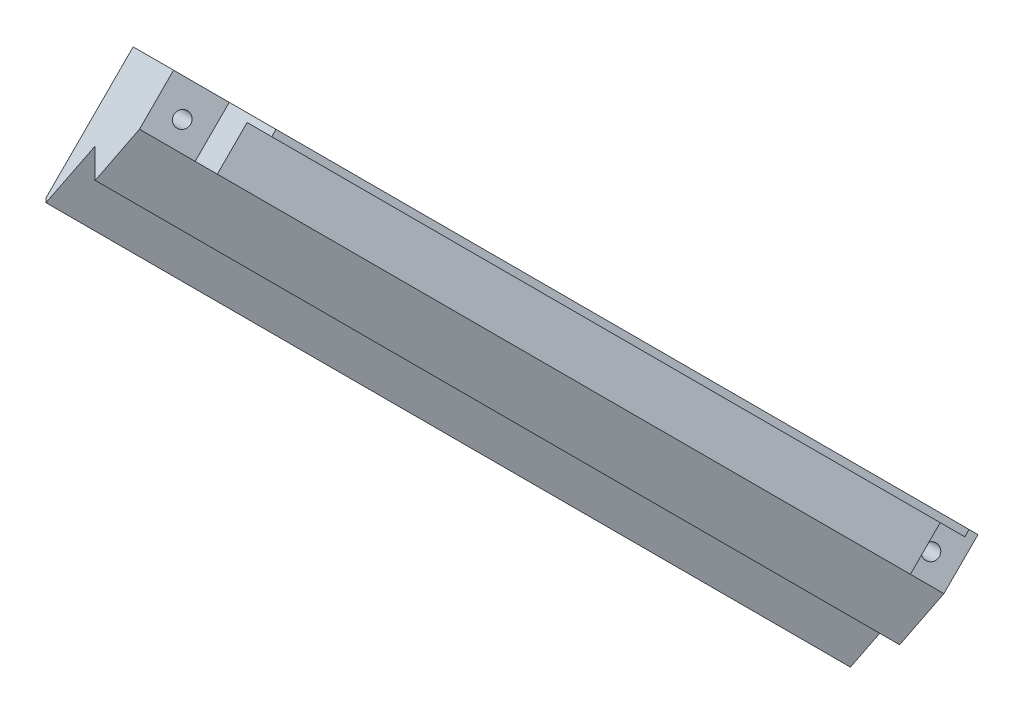
ISO-10303-21;
HEADER;
FILE_DESCRIPTION(('STEP AP214'),'2;1');
FILE_NAME('part.step','',(''),(''),'','','');
FILE_SCHEMA(('AUTOMOTIVE_DESIGN { 1 0 10303 214 1 1 1 1 }'));
ENDSEC;
DATA;
#1=APPLICATION_CONTEXT('core data for automotive mechanical design processes');
#2=APPLICATION_PROTOCOL_DEFINITION('international standard','automotive_design',2000,#1);
#3=PRODUCT_CONTEXT('',#1,'mechanical');
#4=PRODUCT('Part','Part','',(#3));
#5=PRODUCT_RELATED_PRODUCT_CATEGORY('part','',(#4));
#6=PRODUCT_DEFINITION_FORMATION('','',#4);
#7=PRODUCT_DEFINITION_CONTEXT('part definition',#1,'design');
#8=PRODUCT_DEFINITION('design','',#6,#7);
#9=PRODUCT_DEFINITION_SHAPE('','',#8);
#10=(LENGTH_UNIT() NAMED_UNIT(*) SI_UNIT(.MILLI.,.METRE.));
#11=(NAMED_UNIT(*) PLANE_ANGLE_UNIT() SI_UNIT($,.RADIAN.));
#12=(NAMED_UNIT(*) SI_UNIT($,.STERADIAN.) SOLID_ANGLE_UNIT());
#13=UNCERTAINTY_MEASURE_WITH_UNIT(LENGTH_MEASURE(1.E-05),#10,'distance_accuracy_value','');
#14=(GEOMETRIC_REPRESENTATION_CONTEXT(3) GLOBAL_UNCERTAINTY_ASSIGNED_CONTEXT((#13)) GLOBAL_UNIT_ASSIGNED_CONTEXT((#10,
#11,#12)) REPRESENTATION_CONTEXT('',''));
#15=CARTESIAN_POINT('',(0.,0.,0.));
#16=DIRECTION('',(0.,0.,1.));
#17=DIRECTION('',(1.,0.,0.));
#18=AXIS2_PLACEMENT_3D('',#15,#16,#17);
#19=CARTESIAN_POINT('',(109.704877872,0.,155.146126145066));
#20=DIRECTION('',(0.,0.707106781186548,-0.707106781186548));
#21=DIRECTION('',(0.,0.707106781186548,0.707106781186548));
#22=AXIS2_PLACEMENT_3D('',#19,#20,#21);
#23=PLANE('',#22);
#24=DIRECTION('',(0.577677514831549,-0.577186576792135,-0.577186576792135));
#25=VECTOR('',#24,1.);
#26=CARTESIAN_POINT('',(28.8678567839204,-30.6177683850488,124.528357760018));
#27=LINE('',#26,#25);
#28=CARTESIAN_POINT('',(28.8678567839204,-30.6177683850488,124.528357760018));
#29=VERTEX_POINT('',#28);
#30=CARTESIAN_POINT('',(30.6080010146896,-32.356433757848,122.789692387218));
#31=VERTEX_POINT('',#30);
#32=EDGE_CURVE('E419',#29,#31,#27,.T.);
#33=ORIENTED_EDGE('',*,*,#32,.T.);
#34=DIRECTION('',(0.335280806511777,0.666178197175804,0.666178197175807));
#35=VECTOR('',#34,1.);
#36=CARTESIAN_POINT('',(30.6080010146896,-32.356433757848,122.789692387219));
#37=LINE('',#36,#35);
#38=CARTESIAN_POINT('',(32.6559777775101,-28.2872552029885,126.858870942078));
#39=VERTEX_POINT('',#38);
#40=EDGE_CURVE('E64',#31,#39,#37,.T.);
#41=ORIENTED_EDGE('',*,*,#40,.T.);
#42=DIRECTION('',(-0.579378844719787,0.576333303866473,0.576333303866366));
#43=VECTOR('',#42,1.);
#44=CARTESIAN_POINT('',(32.6559777775101,-28.2872552029885,126.858870942078));
#45=LINE('',#44,#43);
#46=CARTESIAN_POINT('',(32.5809276973819,-28.2125996282641,126.933526516802));
#47=VERTEX_POINT('',#46);
#48=EDGE_CURVE('E452',#39,#47,#45,.T.);
#49=ORIENTED_EDGE('',*,*,#48,.T.);
#50=DIRECTION('',(-0.816269111123673,-0.408475665263776,-0.408475665263777));
#51=VECTOR('',#50,1.);
#52=CARTESIAN_POINT('',(32.5809276973819,-28.2125996282641,126.933526516802));
#53=LINE('',#52,#51);
#54=CARTESIAN_POINT('',(28.9950603095614,-30.0070318159176,125.139094329149));
#55=VERTEX_POINT('',#54);
#56=EDGE_CURVE('E448',#47,#55,#53,.T.);
#57=ORIENTED_EDGE('',*,*,#56,.T.);
#58=DIRECTION('',(-0.577600406502366,0.577225159884897,0.577225159884907));
#59=VECTOR('',#58,1.);
#60=CARTESIAN_POINT('',(28.9950603095614,-30.0070318159176,125.139094329149));
#61=LINE('',#60,#59);
#62=CARTESIAN_POINT('',(28.5549361108435,-29.5671935503725,125.578932594694));
#63=VERTEX_POINT('',#62);
#64=EDGE_CURVE('E444',#55,#63,#61,.T.);
#65=ORIENTED_EDGE('',*,*,#64,.T.);
#66=DIRECTION('',(-0.816148802675803,-0.408595846706047,-0.408595846706035));
#67=VECTOR('',#66,1.);
#68=CARTESIAN_POINT('',(28.5549361108435,-29.5671935503725,125.578932594694));
#69=LINE('',#68,#67);
#70=CARTESIAN_POINT('',(28.0626584666127,-29.8136468934387,125.332479251628));
#71=VERTEX_POINT('',#70);
#72=EDGE_CURVE('E440',#63,#71,#69,.T.);
#73=ORIENTED_EDGE('',*,*,#72,.T.);
#74=DIRECTION('',(0.577600406502369,-0.577225159884891,-0.57722515988491));
#75=VECTOR('',#74,1.);
#76=CARTESIAN_POINT('',(28.0626584666127,-29.8136468934387,125.332479251628));
#77=LINE('',#76,#75);
#78=CARTESIAN_POINT('',(28.5027826653307,-30.2534851589838,124.892640986083));
#79=VERTEX_POINT('',#78);
#80=EDGE_CURVE('E436',#71,#79,#77,.T.);
#81=ORIENTED_EDGE('',*,*,#80,.T.);
#82=DIRECTION('',(-0.816246040447928,-0.408498715697545,-0.408498715697535));
#83=VECTOR('',#82,1.);
#84=CARTESIAN_POINT('',(28.5027826653307,-30.2534851589838,124.892640986083));
#85=LINE('',#84,#83);
#86=CARTESIAN_POINT('',(27.3057974890486,-30.8525286862907,124.293597458776));
#87=VERTEX_POINT('',#86);
#88=EDGE_CURVE('E432',#79,#87,#85,.T.);
#89=ORIENTED_EDGE('',*,*,#88,.T.);
#90=DIRECTION('',(0.578185016321361,-0.57693244270948,-0.576932442709491));
#91=VECTOR('',#90,1.);
#92=CARTESIAN_POINT('',(27.3057974890486,-30.8525286862907,124.293597458776));
#93=LINE('',#92,#91);
#94=CARTESIAN_POINT('',(27.6708716076384,-31.2168119123557,123.929314232711));
#95=VERTEX_POINT('',#94);
#96=EDGE_CURVE('E428',#87,#95,#93,.T.);
#97=ORIENTED_EDGE('',*,*,#96,.T.);
#98=DIRECTION('',(0.816246040447931,0.408498715697537,0.408498715697537));
#99=VECTOR('',#98,1.);
#100=CARTESIAN_POINT('',(27.6708716076384,-31.2168119123557,123.929314232711));
#101=LINE('',#100,#99);
#102=EDGE_CURVE('E424',#95,#29,#101,.T.);
#103=ORIENTED_EDGE('',*,*,#102,.T.);
#104=EDGE_LOOP('',(#33,#41,#49,#57,#65,#73,#81,#89,#97,#103));
#105=FACE_BOUND('',#104,.T.);
#106=DIRECTION('',(0.5773502691896,-0.577350269189639,-0.577350269189639));
#107=VECTOR('',#106,1.);
#108=CARTESIAN_POINT('',(38.4539107675018,-35.6254835522467,119.52064259282));
#109=LINE('',#108,#107);
#110=CARTESIAN_POINT('',(10.7425199215219,-7.91409270626494,147.232033438801));
#111=VERTEX_POINT('',#110);
#112=CARTESIAN_POINT('',(13.0519209982803,-10.2234937830235,144.922632362043));
#113=VERTEX_POINT('',#112);
#114=EDGE_CURVE('E224',#111,#113,#109,.T.);
#115=ORIENTED_EDGE('',*,*,#114,.T.);
#116=DIRECTION('',(0.81649658092775,0.408248290463839,0.408248290463839));
#117=VECTOR('',#116,1.);
#118=CARTESIAN_POINT('',(84.3028881027793,25.4019897692229,180.548115914289));
#119=LINE('',#118,#117);
#120=CARTESIAN_POINT('',(20.8086383505286,-6.34513510689969,148.800991038167));
#121=VERTEX_POINT('',#120);
#122=EDGE_CURVE('E523',#113,#121,#119,.T.);
#123=ORIENTED_EDGE('',*,*,#122,.T.);
#124=DIRECTION('',(0.577350269189633,-0.577350269189622,-0.577350269189622));
#125=VECTOR('',#124,1.);
#126=CARTESIAN_POINT('',(18.3525903053945,-3.88908706176727,151.257039083299));
#127=LINE('',#126,#125);
#128=CARTESIAN_POINT('',(49.5596162817953,-35.0961130381675,120.050013106899));
#129=VERTEX_POINT('',#128);
#130=EDGE_CURVE('E259',#121,#129,#127,.T.);
#131=ORIENTED_EDGE('',*,*,#130,.T.);
#132=DIRECTION('',(0.816496580927721,0.408248290463868,0.408248290463868));
#133=VECTOR('',#132,1.);
#134=CARTESIAN_POINT('',(113.053866034043,-3.34898816204304,151.797137983023));
#135=LINE('',#134,#133);
#136=CARTESIAN_POINT('',(41.8028989295473,-38.9744717142916,116.171654430775));
#137=VERTEX_POINT('',#136);
#138=EDGE_CURVE('E50',#137,#129,#135,.T.);
#139=ORIENTED_EDGE('',*,*,#138,.F.);
#140=DIRECTION('',(-0.577350269189625,0.577350269189626,0.577350269189626));
#141=VECTOR('',#140,1.);
#142=CARTESIAN_POINT('',(38.4539107675038,-35.625483552248,119.520642592818));
#143=LINE('',#142,#141);
#144=CARTESIAN_POINT('',(44.1123000063058,-41.28387279105,113.862253354016));
#145=VERTEX_POINT('',#144);
#146=EDGE_CURVE('E287',#145,#137,#143,.T.);
#147=ORIENTED_EDGE('',*,*,#146,.F.);
#148=DIRECTION('',(0.816496580927739,0.40824829046385,0.40824829046385));
#149=VECTOR('',#148,1.);
#150=CARTESIAN_POINT('',(115.363267110803,-5.65838923880318,149.487736906263));
#151=LINE('',#150,#149);
#152=CARTESIAN_POINT('',(37.4055141149248,-44.6372657367405,110.508860408326));
#153=VERTEX_POINT('',#152);
#154=EDGE_CURVE('E275',#153,#145,#151,.T.);
#155=ORIENTED_EDGE('',*,*,#154,.F.);
#156=DIRECTION('',(-0.577350269189617,0.577350269189631,0.57735026918963));
#157=VECTOR('',#156,1.);
#158=CARTESIAN_POINT('',(37.4055141149248,-44.6372657367405,110.508860408326));
#159=LINE('',#158,#157);
#160=CARTESIAN_POINT('',(4.03573403014051,-11.2674856519554,143.878640493111));
#161=VERTEX_POINT('',#160);
#162=EDGE_CURVE('E280',#153,#161,#159,.T.);
#163=ORIENTED_EDGE('',*,*,#162,.T.);
#164=DIRECTION('',(-0.816496580927732,-0.408248290463857,-0.408248290463857));
#165=VECTOR('',#164,1.);
#166=CARTESIAN_POINT('',(81.9934870260181,27.7113908459825,182.857516991049));
#167=LINE('',#166,#165);
#168=EDGE_CURVE('E283',#111,#161,#167,.T.);
#169=ORIENTED_EDGE('',*,*,#168,.F.);
#170=EDGE_LOOP('',(#115,#123,#131,#139,#147,#155,#163,#169));
#171=FACE_BOUND('',#170,.T.);
#172=ADVANCED_FACE('F41',(#105,#171),#23,.T.);
#173=CARTESIAN_POINT('',(18.4992372737687,-4.38928743204907,151.463945516833));
#174=DIRECTION('',(0.577350269189617,-0.577350269189631,-0.57735026918963));
#175=DIRECTION('',(0.,0.707106781186547,-0.707106781186548));
#176=AXIS2_PLACEMENT_3D('',#173,#174,#175);
#177=PLANE('',#176);
#178=DIRECTION('',(0.,-0.707106781186592,0.707106781186503));
#179=VECTOR('',#178,1.);
#180=CARTESIAN_POINT('',(10.7425199215206,12.386673147035,126.931267585504));
#181=LINE('',#180,#179);
#182=CARTESIAN_POINT('',(10.7425199215221,-10.7425199215226,150.060460654059));
#183=VERTEX_POINT('',#182);
#184=EDGE_CURVE('E216',#111,#183,#181,.T.);
#185=ORIENTED_EDGE('',*,*,#184,.F.);
#186=ORIENTED_EDGE('',*,*,#168,.T.);
#187=DIRECTION('',(0.,-0.707106781186545,0.70710678118655));
#188=VECTOR('',#187,1.);
#189=CARTESIAN_POINT('',(4.03573403014054,-18.49923727377,151.110392114926));
#190=LINE('',#189,#188);
#191=CARTESIAN_POINT('',(4.03573403014057,-18.49923727377,151.110392114926));
#192=VERTEX_POINT('',#191);
#193=EDGE_CURVE('E331',#161,#192,#190,.T.);
#194=ORIENTED_EDGE('',*,*,#193,.T.);
#195=DIRECTION('',(-0.70710678118655,0.,-0.707106781186545));
#196=VECTOR('',#195,1.);
#197=CARTESIAN_POINT('',(0.853753502780497,-18.49923727377,147.928411587566));
#198=LINE('',#197,#196);
#199=CARTESIAN_POINT('',(4.38928743204753,-18.49923727377,151.463945516833));
#200=VERTEX_POINT('',#199);
#201=EDGE_CURVE('E238',#200,#192,#198,.T.);
#202=ORIENTED_EDGE('',*,*,#201,.F.);
#203=DIRECTION('',(-0.408248290463871,-0.816496580927723,0.408248290463862));
#204=VECTOR('',#203,1.);
#205=CARTESIAN_POINT('',(35.0681428707689,42.8584736036713,120.785090078112));
#206=LINE('',#205,#204);
#207=CARTESIAN_POINT('',(6.43052884599153,-14.4167544458821,149.422704102889));
#208=VERTEX_POINT('',#207);
#209=EDGE_CURVE('E281',#208,#200,#206,.T.);
#210=ORIENTED_EDGE('',*,*,#209,.F.);
#211=DIRECTION('',(-0.70710678118655,0.,-0.707106781186545));
#212=VECTOR('',#211,1.);
#213=CARTESIAN_POINT('',(6.43052884599175,-14.4167544458821,149.422704102889));
#214=LINE('',#213,#212);
#215=CARTESIAN_POINT('',(8.90540265934042,-14.4167544458821,151.897577916238));
#216=VERTEX_POINT('',#215);
#217=EDGE_CURVE('E234',#216,#208,#214,.T.);
#218=ORIENTED_EDGE('',*,*,#217,.F.);
#219=DIRECTION('',(-0.408248290463866,-0.816496580927723,0.408248290463866));
#220=VECTOR('',#219,1.);
#221=CARTESIAN_POINT('',(48.6441459215211,65.0607320784783,112.158834654057));
#222=LINE('',#221,#220);
#223=EDGE_CURVE('E232',#183,#216,#222,.T.);
#224=ORIENTED_EDGE('',*,*,#223,.F.);
#225=EDGE_LOOP('',(#185,#186,#194,#202,#210,#218,#224));
#226=FACE_BOUND('',#225,.T.);
#227=ADVANCED_FACE('F43',(#226),#177,.F.);
#228=CARTESIAN_POINT('',(113.704878,0.,160.802980575578));
#229=DIRECTION('',(0.,0.707106781186548,-0.707106781186548));
#230=DIRECTION('',(0.,0.707106781186548,0.707106781186548));
#231=AXIS2_PLACEMENT_3D('',#228,#229,#230);
#232=PLANE('',#231);
#233=DIRECTION('',(-0.81649658092775,-0.40824829046384,-0.408248290463838));
#234=VECTOR('',#233,1.);
#235=CARTESIAN_POINT('',(13.0519209982805,-13.051920998281,147.7510595773));
#236=LINE('',#235,#234);
#237=CARTESIAN_POINT('',(16.7261555226397,-11.2148037361015,149.588176839479));
#238=VERTEX_POINT('',#237);
#239=CARTESIAN_POINT('',(13.0519209982805,-13.051920998281,147.7510595773));
#240=VERTEX_POINT('',#239);
#241=EDGE_CURVE('E229',#238,#240,#236,.T.);
#242=ORIENTED_EDGE('',*,*,#241,.T.);
#243=DIRECTION('',(0.577350269189626,-0.577350269189626,-0.577350269189626));
#244=VECTOR('',#243,1.);
#245=CARTESIAN_POINT('',(-37.901626,37.9016259999999,198.704606575578));
#246=LINE('',#245,#244);
#247=CARTESIAN_POINT('',(41.8028989295473,-41.8028989295475,119.000081646031));
#248=VERTEX_POINT('',#247);
#249=EDGE_CURVE('E243',#240,#248,#246,.T.);
#250=ORIENTED_EDGE('',*,*,#249,.T.);
#251=DIRECTION('',(-0.816496580927721,-0.408248290463869,-0.408248290463867));
#252=VECTOR('',#251,1.);
#253=CARTESIAN_POINT('',(41.8028989295473,-41.8028989295475,119.000081646031));
#254=LINE('',#253,#252);
#255=CARTESIAN_POINT('',(45.4771334539074,-39.9657816673674,120.837198908211));
#256=VERTEX_POINT('',#255);
#257=EDGE_CURVE('E376',#256,#248,#254,.T.);
#258=ORIENTED_EDGE('',*,*,#257,.F.);
#259=DIRECTION('',(-0.577350269189633,0.577350269189622,0.577350269189622));
#260=VECTOR('',#259,1.);
#261=CARTESIAN_POINT('',(41.5758605243604,-36.0645087378204,124.738471837758));
#262=LINE('',#261,#260);
#263=EDGE_CURVE('E245',#256,#238,#262,.T.);
#264=ORIENTED_EDGE('',*,*,#263,.T.);
#265=EDGE_LOOP('',(#242,#250,#258,#264));
#266=FACE_BOUND('',#265,.T.);
#267=ADVANCED_FACE('F564',(#266),#232,.F.);
#268=CARTESIAN_POINT('',(8.6933322240979,-0.707106624210344,155.146126324672));
#269=DIRECTION('',(-0.816496580927721,-0.408248290463868,-0.408248290463868));
#270=DIRECTION('',(-0.447213595499965,0.,0.894427190999913));
#271=AXIS2_PLACEMENT_3D('',#268,#269,#270);
#272=PLANE('',#271);
#273=DIRECTION('',(0.,0.707106781186592,-0.707106781186503));
#274=VECTOR('',#273,1.);
#275=CARTESIAN_POINT('',(16.7261555226395,-8.73992992275106,147.113303026129));
#276=LINE('',#275,#274);
#277=CARTESIAN_POINT('',(16.7261555226395,-8.7399299227517,147.11330302613));
#278=VERTEX_POINT('',#277);
#279=EDGE_CURVE('E527',#238,#278,#276,.T.);
#280=ORIENTED_EDGE('',*,*,#279,.F.);
#281=ORIENTED_EDGE('',*,*,#263,.F.);
#282=DIRECTION('',(0.,0.707106781186548,-0.707106781186548));
#283=VECTOR('',#282,1.);
#284=CARTESIAN_POINT('',(45.4771334539074,-37.4909078540192,118.362325094863));
#285=LINE('',#284,#283);
#286=CARTESIAN_POINT('',(45.4771334539074,-37.4909078540186,118.362325094862));
#287=VERTEX_POINT('',#286);
#288=EDGE_CURVE('E318',#256,#287,#285,.T.);
#289=ORIENTED_EDGE('',*,*,#288,.T.);
#290=DIRECTION('',(0.577350269189633,-0.577350269189613,-0.577350269189631));
#291=VECTOR('',#290,1.);
#292=CARTESIAN_POINT('',(8.6933322240979,-0.707106624210344,155.146126324672));
#293=LINE('',#292,#291);
#294=EDGE_CURVE('E252',#278,#287,#293,.T.);
#295=ORIENTED_EDGE('',*,*,#294,.F.);
#296=EDGE_LOOP('',(#280,#281,#289,#295));
#297=FACE_BOUND('',#296,.T.);
#298=ADVANCED_FACE('F652',(#297),#272,.F.);
#299=CARTESIAN_POINT('',(7.94035660287711E-13,-77.926616474441,77.9266164744393));
#300=DIRECTION('',(0.,0.707106781186555,-0.70710678118654));
#301=DIRECTION('',(0.,0.70710678118654,0.707106781186555));
#302=AXIS2_PLACEMENT_3D('',#299,#300,#301);
#303=PLANE('',#302);
#304=DIRECTION('',(0.81649658092775,0.408248290463839,0.408248290463839));
#305=VECTOR('',#304,1.);
#306=CARTESIAN_POINT('',(-40.5490725269122,-37.377543947525,118.475689001357));
#307=LINE('',#306,#305);
#308=CARTESIAN_POINT('',(20.8086383505276,-6.69868850880786,149.154544440074));
#309=VERTEX_POINT('',#308);
#310=EDGE_CURVE('E56',#278,#309,#307,.T.);
#311=ORIENTED_EDGE('',*,*,#310,.F.);
#312=ORIENTED_EDGE('',*,*,#294,.T.);
#313=DIRECTION('',(0.816496580927721,0.408248290463868,0.408248290463868));
#314=VECTOR('',#313,1.);
#315=CARTESIAN_POINT('',(-11.7980945956452,-66.1285218787954,89.7247110700853));
#316=LINE('',#315,#314);
#317=CARTESIAN_POINT('',(49.5596162817953,-35.4496664400746,120.403566508806));
#318=VERTEX_POINT('',#317);
#319=EDGE_CURVE('E313',#287,#318,#316,.T.);
#320=ORIENTED_EDGE('',*,*,#319,.T.);
#321=DIRECTION('',(-0.577350269189633,0.577350269189613,0.577350269189631));
#322=VECTOR('',#321,1.);
#323=CARTESIAN_POINT('',(61.3577108774413,-47.2477610357202,108.60547191316));
#324=LINE('',#323,#322);
#325=EDGE_CURVE('E263',#318,#309,#324,.T.);
#326=ORIENTED_EDGE('',*,*,#325,.T.);
#327=EDGE_LOOP('',(#311,#312,#320,#326));
#328=FACE_BOUND('',#327,.T.);
#329=ADVANCED_FACE('F649',(#328),#303,.F.);
#330=CARTESIAN_POINT('',(18.3525903053945,-0.707106534407632,148.07505855594));
#331=DIRECTION('',(-0.816496580927721,-0.408248290463868,-0.408248290463868));
#332=DIRECTION('',(-0.447213595499965,0.,0.894427190999912));
#333=AXIS2_PLACEMENT_3D('',#330,#331,#332);
#334=PLANE('',#333);
#335=DIRECTION('',(0.,0.707106781186592,-0.707106781186503));
#336=VECTOR('',#335,1.);
#337=CARTESIAN_POINT('',(20.8086383505274,-3.16315457954017,145.619010510807));
#338=LINE('',#337,#336);
#339=EDGE_CURVE('E11',#309,#121,#338,.T.);
#340=ORIENTED_EDGE('',*,*,#339,.F.);
#341=ORIENTED_EDGE('',*,*,#325,.F.);
#342=DIRECTION('',(0.,-0.707106781186548,0.707106781186547));
#343=VECTOR('',#342,1.);
#344=CARTESIAN_POINT('',(49.5596162817953,-14.795347184868,99.7492472535995));
#345=LINE('',#344,#343);
#346=EDGE_CURVE('E302',#129,#318,#345,.T.);
#347=ORIENTED_EDGE('',*,*,#346,.F.);
#348=ORIENTED_EDGE('',*,*,#130,.F.);
#349=EDGE_LOOP('',(#340,#341,#347,#348));
#350=FACE_BOUND('',#349,.T.);
#351=ADVANCED_FACE('F311',(#350),#334,.F.);
#352=CARTESIAN_POINT('',(77.9266164744402,-8.16237981659082E-13,77.9266164744402));
#353=DIRECTION('',(-0.707106781186548,0.,-0.707106781186548));
#354=DIRECTION('',(0.707106781186548,0.,-0.707106781186548));
#355=AXIS2_PLACEMENT_3D('',#352,#353,#354);
#356=PLANE('',#355);
#357=DIRECTION('',(-0.577350269189625,0.577350269189621,0.577350269189631));
#358=VECTOR('',#357,1.);
#359=CARTESIAN_POINT('',(41.4412483246716,-49.4274739245619,114.411984624208));
#360=LINE('',#359,#358);
#361=CARTESIAN_POINT('',(39.8003089307766,-47.7865345306669,116.052924018103));
#362=VERTEX_POINT('',#361);
#363=EDGE_CURVE('E258',#362,#208,#360,.T.);
#364=ORIENTED_EDGE('',*,*,#363,.T.);
#365=ORIENTED_EDGE('',*,*,#209,.T.);
#366=DIRECTION('',(0.577350269189625,-0.577350269189621,-0.577350269189631));
#367=VECTOR('',#366,1.);
#368=CARTESIAN_POINT('',(47.2477610357198,-61.3577108774419,108.60547191316));
#369=LINE('',#368,#367);
#370=CARTESIAN_POINT('',(37.7590675168327,-51.869017358555,118.094165432047));
#371=VERTEX_POINT('',#370);
#372=EDGE_CURVE('E266',#200,#371,#369,.T.);
#373=ORIENTED_EDGE('',*,*,#372,.T.);
#374=DIRECTION('',(0.408248290463835,0.816496580927758,-0.408248290463826));
#375=VECTOR('',#374,1.);
#376=CARTESIAN_POINT('',(68.4379229555507,9.48869351888761,87.4153099933298));
#377=LINE('',#376,#375);
#378=EDGE_CURVE('E279',#371,#362,#377,.T.);
#379=ORIENTED_EDGE('',*,*,#378,.T.);
#380=EDGE_LOOP('',(#364,#365,#373,#379));
#381=FACE_BOUND('',#380,.T.);
#382=ADVANCED_FACE('F358',(#381),#356,.F.);
#383=CARTESIAN_POINT('',(0.,113.704878,160.802980575578));
#384=DIRECTION('',(-0.707106781186548,0.,-0.707106781186548));
#385=DIRECTION('',(-0.707106781186548,0.,0.707106781186548));
#386=AXIS2_PLACEMENT_3D('',#383,#384,#385);
#387=PLANE('',#386);
#388=EDGE_CURVE('E221',#183,#240,#246,.T.);
#389=ORIENTED_EDGE('',*,*,#388,.F.);
#390=ORIENTED_EDGE('',*,*,#223,.T.);
#391=DIRECTION('',(0.577350269189628,-0.577350269189621,-0.577350269189628));
#392=VECTOR('',#391,1.);
#393=CARTESIAN_POINT('',(-39.7387432621804,34.2273914756381,200.541723837758));
#394=LINE('',#393,#392);
#395=CARTESIAN_POINT('',(42.2751827441257,-47.786534530667,118.527797831452));
#396=VERTEX_POINT('',#395);
#397=EDGE_CURVE('E250',#216,#396,#394,.T.);
#398=ORIENTED_EDGE('',*,*,#397,.T.);
#399=DIRECTION('',(0.408248290463831,0.816496580927758,-0.408248290463831));
#400=VECTOR('',#399,1.);
#401=CARTESIAN_POINT('',(82.0139260063062,31.6909519937034,78.7890545692718));
#402=LINE('',#401,#400);
#403=CARTESIAN_POINT('',(44.1123000063058,-44.112300006306,116.690680569272));
#404=VERTEX_POINT('',#403);
#405=EDGE_CURVE('E274',#396,#404,#402,.T.);
#406=ORIENTED_EDGE('',*,*,#405,.T.);
#407=DIRECTION('',(0.577350269189625,-0.577350269189626,-0.577350269189626));
#408=VECTOR('',#407,1.);
#409=CARTESIAN_POINT('',(41.8028989295473,-41.8028989295475,119.000081646031));
#410=LINE('',#409,#408);
#411=EDGE_CURVE('E323',#248,#404,#410,.T.);
#412=ORIENTED_EDGE('',*,*,#411,.F.);
#413=ORIENTED_EDGE('',*,*,#249,.F.);
#414=EDGE_LOOP('',(#389,#390,#398,#406,#412,#413));
#415=FACE_BOUND('',#414,.T.);
#416=ADVANCED_FACE('F241',(#415),#387,.F.);
#417=CARTESIAN_POINT('',(37.7590675168328,-51.869017358555,118.094165432047));
#418=DIRECTION('',(-0.577350269189608,0.57735026918958,0.57735026918969));
#419=DIRECTION('',(0.707106781186598,0.,0.707106781186497));
#420=AXIS2_PLACEMENT_3D('',#417,#418,#419);
#421=PLANE('',#420);
#422=ORIENTED_EDGE('',*,*,#154,.T.);
#423=DIRECTION('',(0.,-0.707106781186548,0.707106781186547));
#424=VECTOR('',#423,1.);
#425=CARTESIAN_POINT('',(44.1123000063058,-20.9831069377506,93.5614875007169));
#426=LINE('',#425,#424);
#427=EDGE_CURVE('E314',#145,#404,#426,.T.);
#428=ORIENTED_EDGE('',*,*,#427,.T.);
#429=ORIENTED_EDGE('',*,*,#405,.F.);
#430=DIRECTION('',(0.707106781186579,0.,0.707106781186517));
#431=VECTOR('',#430,1.);
#432=CARTESIAN_POINT('',(39.8003089307767,-47.7865345306669,116.052924018103));
#433=LINE('',#432,#431);
#434=EDGE_CURVE('E344',#362,#396,#433,.T.);
#435=ORIENTED_EDGE('',*,*,#434,.F.);
#436=ORIENTED_EDGE('',*,*,#378,.F.);
#437=DIRECTION('',(0.707106781186579,0.,0.707106781186517));
#438=VECTOR('',#437,1.);
#439=CARTESIAN_POINT('',(34.2235335875654,-51.8690173585548,114.55863150278));
#440=LINE('',#439,#438);
#441=CARTESIAN_POINT('',(37.4055141149259,-51.869017358555,117.74061203014));
#442=VERTEX_POINT('',#441);
#443=EDGE_CURVE('E348',#442,#371,#440,.T.);
#444=ORIENTED_EDGE('',*,*,#443,.F.);
#445=DIRECTION('',(0.,-0.707106781186545,0.70710678118655));
#446=VECTOR('',#445,1.);
#447=CARTESIAN_POINT('',(37.4055141149248,-51.8690173585551,117.740612030141));
#448=LINE('',#447,#446);
#449=EDGE_CURVE('E332',#153,#442,#448,.T.);
#450=ORIENTED_EDGE('',*,*,#449,.F.);
#451=EDGE_LOOP('',(#422,#428,#429,#435,#436,#444,#450));
#452=FACE_BOUND('',#451,.T.);
#453=ADVANCED_FACE('F363',(#452),#421,.F.);
#454=CARTESIAN_POINT('',(41.4412483246716,-49.4274739245619,114.411984624208));
#455=DIRECTION('',(0.408248290463864,0.81649658092773,-0.408248290463855));
#456=DIRECTION('',(-0.894427190999916,0.447213595499957,0.));
#457=AXIS2_PLACEMENT_3D('',#454,#455,#456);
#458=PLANE('',#457);
#459=ORIENTED_EDGE('',*,*,#397,.F.);
#460=ORIENTED_EDGE('',*,*,#217,.T.);
#461=ORIENTED_EDGE('',*,*,#363,.F.);
#462=ORIENTED_EDGE('',*,*,#434,.T.);
#463=EDGE_LOOP('',(#459,#460,#461,#462));
#464=FACE_BOUND('',#463,.T.);
#465=ADVANCED_FACE('F656',(#464),#458,.F.);
#466=CARTESIAN_POINT('',(34.3701805559397,-52.0156643269291,114.411984534406));
#467=DIRECTION('',(0.408248290463864,0.81649658092773,-0.408248290463855));
#468=DIRECTION('',(-0.894427190999916,0.447213595499957,0.));
#469=AXIS2_PLACEMENT_3D('',#466,#467,#468);
#470=PLANE('',#469);
#471=ORIENTED_EDGE('',*,*,#372,.F.);
#472=ORIENTED_EDGE('',*,*,#201,.T.);
#473=DIRECTION('',(-0.577350269189628,0.577350269189621,0.577350269189628));
#474=VECTOR('',#473,1.);
#475=CARTESIAN_POINT('',(37.5521610833001,-52.0156643269291,117.593965061766));
#476=LINE('',#475,#474);
#477=EDGE_CURVE('E262',#442,#192,#476,.T.);
#478=ORIENTED_EDGE('',*,*,#477,.F.);
#479=ORIENTED_EDGE('',*,*,#443,.T.);
#480=EDGE_LOOP('',(#471,#472,#478,#479));
#481=FACE_BOUND('',#480,.T.);
#482=ADVANCED_FACE('F368',(#481),#470,.F.);
#483=CARTESIAN_POINT('',(37.4055141149248,-51.8690173585551,117.740612030141));
#484=DIRECTION('',(-0.816496580927732,-0.40824829046386,-0.408248290463853));
#485=DIRECTION('',(0.447213595499952,-0.894427190999919,0.));
#486=AXIS2_PLACEMENT_3D('',#483,#484,#485);
#487=PLANE('',#486);
#488=CARTESIAN_POINT('',(5.19043456851991,-14.0131764989178,144.314930263315));
#489=DIRECTION('',(-0.816496580927732,-0.40824829046386,-0.408248290463853));
#490=DIRECTION('',(0.447213595499952,-0.894427190999919,0.));
#491=AXIS2_PLACEMENT_3D('',#488,#489,#490);
#492=CIRCLE('',#491,0.600000000000019);
#493=CARTESIAN_POINT('',(5.45876272581989,-14.5498328135177,144.314930263315));
#494=VERTEX_POINT('',#493);
#495=EDGE_CURVE('E536',#494,#494,#492,.F.);
#496=ORIENTED_EDGE('',*,*,#495,.T.);
#497=EDGE_LOOP('',(#496));
#498=FACE_BOUND('',#497,.T.);
#499=CARTESIAN_POINT('',(36.2508135765457,-45.0735555069428,113.254551255287));
#500=DIRECTION('',(-0.816496580927732,-0.40824829046386,-0.408248290463853));
#501=DIRECTION('',(0.447213595499952,-0.894427190999919,0.));
#502=AXIS2_PLACEMENT_3D('',#499,#500,#501);
#503=CIRCLE('',#502,0.600000000000019);
#504=CARTESIAN_POINT('',(36.5191417338456,-45.6102118215428,113.254551255287));
#505=VERTEX_POINT('',#504);
#506=EDGE_CURVE('E378',#505,#505,#503,.T.);
#507=ORIENTED_EDGE('',*,*,#506,.F.);
#508=EDGE_LOOP('',(#507));
#509=FACE_BOUND('',#508,.T.);
#510=ORIENTED_EDGE('',*,*,#193,.F.);
#511=ORIENTED_EDGE('',*,*,#162,.F.);
#512=ORIENTED_EDGE('',*,*,#449,.T.);
#513=ORIENTED_EDGE('',*,*,#477,.T.);
#514=EDGE_LOOP('',(#510,#511,#512,#513));
#515=FACE_BOUND('',#514,.T.);
#516=ADVANCED_FACE('F372',(#498,#509,#515),#487,.T.);
#517=CARTESIAN_POINT('',(41.8028989295473,-18.6737058609921,95.8708885774754));
#518=DIRECTION('',(-0.577350269189633,0.577350269189622,0.577350269189622));
#519=DIRECTION('',(0.707106781186541,0.,0.707106781186554));
#520=AXIS2_PLACEMENT_3D('',#517,#518,#519);
#521=PLANE('',#520);
#522=ORIENTED_EDGE('',*,*,#257,.T.);
#523=DIRECTION('',(0.,-0.707106781186548,0.707106781186547));
#524=VECTOR('',#523,1.);
#525=CARTESIAN_POINT('',(41.8028989295473,-18.6737058609921,95.8708885774754));
#526=LINE('',#525,#524);
#527=EDGE_CURVE('E305',#137,#248,#526,.T.);
#528=ORIENTED_EDGE('',*,*,#527,.F.);
#529=ORIENTED_EDGE('',*,*,#138,.T.);
#530=ORIENTED_EDGE('',*,*,#346,.T.);
#531=ORIENTED_EDGE('',*,*,#319,.F.);
#532=ORIENTED_EDGE('',*,*,#288,.F.);
#533=EDGE_LOOP('',(#522,#528,#529,#530,#531,#532));
#534=FACE_BOUND('',#533,.T.);
#535=ADVANCED_FACE('F300',(#534),#521,.F.);
#536=CARTESIAN_POINT('',(41.8028989295473,-18.6737058609921,95.8708885774754));
#537=DIRECTION('',(-0.816496580927727,-0.408248290463862,-0.408248290463862));
#538=DIRECTION('',(-0.447213595499957,0.,0.894427190999916));
#539=AXIS2_PLACEMENT_3D('',#536,#537,#538);
#540=PLANE('',#539);
#541=CARTESIAN_POINT('',(42.9575994679266,-41.7201625612524,116.607944200977));
#542=DIRECTION('',(0.816496580927727,0.408248290463862,0.408248290463862));
#543=DIRECTION('',(-0.447213595499957,0.894427190999916,0.));
#544=AXIS2_PLACEMENT_3D('',#541,#542,#543);
#545=CIRCLE('',#544,0.600000000000019);
#546=CARTESIAN_POINT('',(42.6892713106266,-41.1835062466524,116.607944200977));
#547=VERTEX_POINT('',#546);
#548=EDGE_CURVE('E382',#547,#547,#545,.T.);
#549=ORIENTED_EDGE('',*,*,#548,.F.);
#550=EDGE_LOOP('',(#549));
#551=FACE_BOUND('',#550,.T.);
#552=ORIENTED_EDGE('',*,*,#146,.T.);
#553=ORIENTED_EDGE('',*,*,#527,.T.);
#554=ORIENTED_EDGE('',*,*,#411,.T.);
#555=ORIENTED_EDGE('',*,*,#427,.F.);
#556=EDGE_LOOP('',(#552,#553,#554,#555));
#557=FACE_BOUND('',#556,.T.);
#558=ADVANCED_FACE('F374',(#551,#557),#540,.F.);
#559=CARTESIAN_POINT('',(11.5937096460846,-57.4021074721733,100.925999290056));
#560=DIRECTION('',(0.816496580927727,0.408248290463862,0.408248290463862));
#561=DIRECTION('',(-0.447213595499957,0.894427190999916,0.));
#562=AXIS2_PLACEMENT_3D('',#559,#560,#561);
#563=CYLINDRICAL_SURFACE('',#562,0.600000000000019);
#564=ORIENTED_EDGE('',*,*,#506,.T.);
#565=EDGE_LOOP('',(#564));
#566=FACE_BOUND('',#565,.T.);
#567=ORIENTED_EDGE('',*,*,#548,.T.);
#568=EDGE_LOOP('',(#567));
#569=FACE_BOUND('',#568,.T.);
#570=ADVANCED_FACE('F637',(#566,#569),#563,.F.);
#571=CARTESIAN_POINT('',(30.6080010146896,-32.6392764703226,123.072535099693));
#572=DIRECTION('',(-0.942118241403282,0.237079331886172,0.237079331886172));
#573=DIRECTION('',(0.244036747941728,0.,0.969765984995363));
#574=AXIS2_PLACEMENT_3D('',#571,#572,#573);
#575=PLANE('',#574);
#576=ORIENTED_EDGE('',*,*,#40,.F.);
#577=DIRECTION('',(0.,0.707106781186548,-0.707106781186548));
#578=VECTOR('',#577,1.);
#579=CARTESIAN_POINT('',(30.6080010146896,-32.6392764703226,123.072535099693));
#580=LINE('',#579,#578);
#581=CARTESIAN_POINT('',(30.6080010146896,-32.6392764703226,123.072535099693));
#582=VERTEX_POINT('',#581);
#583=EDGE_CURVE('E415',#582,#31,#580,.T.);
#584=ORIENTED_EDGE('',*,*,#583,.F.);
#585=DIRECTION('',(0.335280806511777,0.666178197175804,0.666178197175807));
#586=VECTOR('',#585,1.);
#587=CARTESIAN_POINT('',(30.6080010146896,-32.6392764703226,123.072535099693));
#588=LINE('',#587,#586);
#589=CARTESIAN_POINT('',(32.6559777775101,-28.5700979154631,127.141713654553));
#590=VERTEX_POINT('',#589);
#591=EDGE_CURVE('E423',#582,#590,#588,.T.);
#592=ORIENTED_EDGE('',*,*,#591,.T.);
#593=DIRECTION('',(0.,0.707106781186548,-0.707106781186548));
#594=VECTOR('',#593,1.);
#595=CARTESIAN_POINT('',(32.6559777775101,-28.5700979154631,127.141713654553));
#596=LINE('',#595,#594);
#597=EDGE_CURVE('E388',#590,#39,#596,.T.);
#598=ORIENTED_EDGE('',*,*,#597,.T.);
#599=EDGE_LOOP('',(#576,#584,#592,#598));
#600=FACE_BOUND('',#599,.T.);
#601=ADVANCED_FACE('F633',(#600),#575,.T.);
#602=CARTESIAN_POINT('',(32.6559777775101,-28.5700979154631,127.141713654553));
#603=DIRECTION('',(-0.815058374775184,-0.409682709977389,-0.409682709977389));
#604=DIRECTION('',(-0.449101181147384,0.,0.893480905835164));
#605=AXIS2_PLACEMENT_3D('',#602,#603,#604);
#606=PLANE('',#605);
#607=ORIENTED_EDGE('',*,*,#48,.F.);
#608=ORIENTED_EDGE('',*,*,#597,.F.);
#609=DIRECTION('',(-0.579378844719787,0.576333303866473,0.576333303866366));
#610=VECTOR('',#609,1.);
#611=CARTESIAN_POINT('',(32.6559777775101,-28.5700979154631,127.141713654553));
#612=LINE('',#611,#610);
#613=CARTESIAN_POINT('',(32.5809276973819,-28.4954423407387,127.216369229277));
#614=VERTEX_POINT('',#613);
#615=EDGE_CURVE('E482',#590,#614,#612,.T.);
#616=ORIENTED_EDGE('',*,*,#615,.T.);
#617=DIRECTION('',(0.,0.707106781186548,-0.707106781186548));
#618=VECTOR('',#617,1.);
#619=CARTESIAN_POINT('',(32.5809276973819,-28.4954423407387,127.216369229277));
#620=LINE('',#619,#618);
#621=EDGE_CURVE('E391',#614,#47,#620,.T.);
#622=ORIENTED_EDGE('',*,*,#621,.T.);
#623=EDGE_LOOP('',(#607,#608,#616,#622));
#624=FACE_BOUND('',#623,.T.);
#625=ADVANCED_FACE('F629',(#624),#606,.T.);
#626=CARTESIAN_POINT('',(32.5809276973819,-28.4954423407387,127.216369229277));
#627=DIRECTION('',(0.577671825715405,-0.577189423748664,-0.577189423748665));
#628=DIRECTION('',(-0.706811350964505,0.,-0.70740208802896));
#629=AXIS2_PLACEMENT_3D('',#626,#627,#628);
#630=PLANE('',#629);
#631=ORIENTED_EDGE('',*,*,#56,.F.);
#632=ORIENTED_EDGE('',*,*,#621,.F.);
#633=DIRECTION('',(-0.816269111123673,-0.408475665263776,-0.408475665263777));
#634=VECTOR('',#633,1.);
#635=CARTESIAN_POINT('',(32.5809276973819,-28.4954423407387,127.216369229277));
#636=LINE('',#635,#634);
#637=CARTESIAN_POINT('',(28.9950603095614,-30.2898745283922,125.421937041623));
#638=VERTEX_POINT('',#637);
#639=EDGE_CURVE('E479',#614,#638,#636,.T.);
#640=ORIENTED_EDGE('',*,*,#639,.T.);
#641=DIRECTION('',(0.,0.707106781186548,-0.707106781186548));
#642=VECTOR('',#641,1.);
#643=CARTESIAN_POINT('',(28.9950603095614,-30.2898745283922,125.421937041623));
#644=LINE('',#643,#642);
#645=EDGE_CURVE('E394',#638,#55,#644,.T.);
#646=ORIENTED_EDGE('',*,*,#645,.T.);
#647=EDGE_LOOP('',(#631,#632,#640,#646));
#648=FACE_BOUND('',#647,.T.);
#649=ADVANCED_FACE('F625',(#648),#630,.T.);
#650=CARTESIAN_POINT('',(28.9950603095614,-30.2898745283922,125.421937041623));
#651=DIRECTION('',(-0.816319649652207,-0.408425164253929,-0.408425164253929));
#652=DIRECTION('',(-0.447446132363938,0.,0.894310884778081));
#653=AXIS2_PLACEMENT_3D('',#650,#651,#652);
#654=PLANE('',#653);
#655=ORIENTED_EDGE('',*,*,#64,.F.);
#656=ORIENTED_EDGE('',*,*,#645,.F.);
#657=DIRECTION('',(-0.577600406502366,0.577225159884897,0.577225159884907));
#658=VECTOR('',#657,1.);
#659=CARTESIAN_POINT('',(28.9950603095614,-30.2898745283922,125.421937041623));
#660=LINE('',#659,#658);
#661=CARTESIAN_POINT('',(28.5549361108435,-29.8500362628471,125.861775307169));
#662=VERTEX_POINT('',#661);
#663=EDGE_CURVE('E476',#638,#662,#660,.T.);
#664=ORIENTED_EDGE('',*,*,#663,.T.);
#665=DIRECTION('',(0.,0.707106781186548,-0.707106781186548));
#666=VECTOR('',#665,1.);
#667=CARTESIAN_POINT('',(28.5549361108435,-29.8500362628471,125.861775307169));
#668=LINE('',#667,#666);
#669=EDGE_CURVE('E397',#662,#63,#668,.T.);
#670=ORIENTED_EDGE('',*,*,#669,.T.);
#671=EDGE_LOOP('',(#655,#656,#664,#670));
#672=FACE_BOUND('',#671,.T.);
#673=ADVANCED_FACE('F621',(#672),#654,.T.);
#674=CARTESIAN_POINT('',(28.5549361108435,-29.8500362628471,125.861775307169));
#675=DIRECTION('',(0.577841787941001,-0.577104352829342,-0.577104352829342));
#676=DIRECTION('',(-0.706655148235652,0.,-0.707558125861083));
#677=AXIS2_PLACEMENT_3D('',#674,#675,#676);
#678=PLANE('',#677);
#679=ORIENTED_EDGE('',*,*,#72,.F.);
#680=ORIENTED_EDGE('',*,*,#669,.F.);
#681=DIRECTION('',(-0.816148802675803,-0.408595846706047,-0.408595846706035));
#682=VECTOR('',#681,1.);
#683=CARTESIAN_POINT('',(28.5549361108435,-29.8500362628471,125.861775307169));
#684=LINE('',#683,#682);
#685=CARTESIAN_POINT('',(28.0626584666127,-30.0964896059133,125.615321964102));
#686=VERTEX_POINT('',#685);
#687=EDGE_CURVE('E473',#662,#686,#684,.T.);
#688=ORIENTED_EDGE('',*,*,#687,.T.);
#689=DIRECTION('',(0.,0.707106781186548,-0.707106781186548));
#690=VECTOR('',#689,1.);
#691=CARTESIAN_POINT('',(28.0626584666127,-30.0964896059133,125.615321964102));
#692=LINE('',#691,#690);
#693=EDGE_CURVE('E400',#686,#71,#692,.T.);
#694=ORIENTED_EDGE('',*,*,#693,.T.);
#695=EDGE_LOOP('',(#679,#680,#688,#694));
#696=FACE_BOUND('',#695,.T.);
#697=ADVANCED_FACE('F617',(#696),#678,.T.);
#698=CARTESIAN_POINT('',(28.0626584666127,-30.0964896059133,125.615321964102));
#699=DIRECTION('',(0.816319649652205,0.408425164253932,0.408425164253932));
#700=DIRECTION('',(0.447446132363941,0.,-0.894310884778079));
#701=AXIS2_PLACEMENT_3D('',#698,#699,#700);
#702=PLANE('',#701);
#703=ORIENTED_EDGE('',*,*,#80,.F.);
#704=ORIENTED_EDGE('',*,*,#693,.F.);
#705=DIRECTION('',(0.577600406502369,-0.577225159884891,-0.57722515988491));
#706=VECTOR('',#705,1.);
#707=CARTESIAN_POINT('',(28.0626584666127,-30.0964896059133,125.615321964102));
#708=LINE('',#707,#706);
#709=CARTESIAN_POINT('',(28.5027826653307,-30.5363278714584,125.175483698557));
#710=VERTEX_POINT('',#709);
#711=EDGE_CURVE('E470',#686,#710,#708,.T.);
#712=ORIENTED_EDGE('',*,*,#711,.T.);
#713=DIRECTION('',(0.,0.707106781186548,-0.707106781186548));
#714=VECTOR('',#713,1.);
#715=CARTESIAN_POINT('',(28.5027826653307,-30.5363278714584,125.175483698557));
#716=LINE('',#715,#714);
#717=EDGE_CURVE('E403',#710,#79,#716,.T.);
#718=ORIENTED_EDGE('',*,*,#717,.T.);
#719=EDGE_LOOP('',(#703,#704,#712,#718));
#720=FACE_BOUND('',#719,.T.);
#721=ADVANCED_FACE('F613',(#720),#702,.T.);
#722=CARTESIAN_POINT('',(28.5027826653307,-30.5363278714584,125.175483698557));
#723=DIRECTION('',(0.577704423951452,-0.577173110317399,-0.577173110317399));
#724=DIRECTION('',(-0.70678139442995,0.,-0.707432018279958));
#725=AXIS2_PLACEMENT_3D('',#722,#723,#724);
#726=PLANE('',#725);
#727=ORIENTED_EDGE('',*,*,#88,.F.);
#728=ORIENTED_EDGE('',*,*,#717,.F.);
#729=DIRECTION('',(-0.816246040447928,-0.408498715697545,-0.408498715697535));
#730=VECTOR('',#729,1.);
#731=CARTESIAN_POINT('',(28.5027826653307,-30.5363278714584,125.175483698557));
#732=LINE('',#731,#730);
#733=CARTESIAN_POINT('',(27.3057974890486,-31.1353713987653,124.57644017125));
#734=VERTEX_POINT('',#733);
#735=EDGE_CURVE('E467',#710,#734,#732,.T.);
#736=ORIENTED_EDGE('',*,*,#735,.T.);
#737=DIRECTION('',(0.,0.707106781186548,-0.707106781186548));
#738=VECTOR('',#737,1.);
#739=CARTESIAN_POINT('',(27.3057974890486,-31.1353713987653,124.57644017125));
#740=LINE('',#739,#738);
#741=EDGE_CURVE('E406',#734,#87,#740,.T.);
#742=ORIENTED_EDGE('',*,*,#741,.T.);
#743=EDGE_LOOP('',(#727,#728,#736,#742));
#744=FACE_BOUND('',#743,.T.);
#745=ADVANCED_FACE('F609',(#744),#726,.T.);
#746=CARTESIAN_POINT('',(27.3057974890486,-31.1353713987653,124.57644017125));
#747=DIRECTION('',(0.815905685052793,0.408838545821289,0.408838545821289));
#748=DIRECTION('',(0.44798984319134,0.,-0.894038645919403));
#749=AXIS2_PLACEMENT_3D('',#746,#747,#748);
#750=PLANE('',#749);
#751=ORIENTED_EDGE('',*,*,#96,.F.);
#752=ORIENTED_EDGE('',*,*,#741,.F.);
#753=DIRECTION('',(0.578185016321361,-0.57693244270948,-0.576932442709491));
#754=VECTOR('',#753,1.);
#755=CARTESIAN_POINT('',(27.3057974890486,-31.1353713987653,124.57644017125));
#756=LINE('',#755,#754);
#757=CARTESIAN_POINT('',(27.6708716076384,-31.4996546248303,124.212156945185));
#758=VERTEX_POINT('',#757);
#759=EDGE_CURVE('E464',#734,#758,#756,.T.);
#760=ORIENTED_EDGE('',*,*,#759,.T.);
#761=DIRECTION('',(0.,0.707106781186548,-0.707106781186548));
#762=VECTOR('',#761,1.);
#763=CARTESIAN_POINT('',(27.6708716076384,-31.4996546248303,124.212156945185));
#764=LINE('',#763,#762);
#765=EDGE_CURVE('E409',#758,#95,#764,.T.);
#766=ORIENTED_EDGE('',*,*,#765,.T.);
#767=EDGE_LOOP('',(#751,#752,#760,#766));
#768=FACE_BOUND('',#767,.T.);
#769=ADVANCED_FACE('F605',(#768),#750,.T.);
#770=CARTESIAN_POINT('',(27.6708716076384,-31.4996546248303,124.212156945185));
#771=DIRECTION('',(-0.577704423951448,0.577173110317401,0.577173110317401));
#772=DIRECTION('',(0.706781394429954,0.,0.707432018279954));
#773=AXIS2_PLACEMENT_3D('',#770,#771,#772);
#774=PLANE('',#773);
#775=ORIENTED_EDGE('',*,*,#102,.F.);
#776=ORIENTED_EDGE('',*,*,#765,.F.);
#777=DIRECTION('',(0.816246040447931,0.408498715697537,0.408498715697537));
#778=VECTOR('',#777,1.);
#779=CARTESIAN_POINT('',(27.6708716076384,-31.4996546248303,124.212156945185));
#780=LINE('',#779,#778);
#781=CARTESIAN_POINT('',(28.8678567839204,-30.9006110975234,124.811200472492));
#782=VERTEX_POINT('',#781);
#783=EDGE_CURVE('E461',#758,#782,#780,.T.);
#784=ORIENTED_EDGE('',*,*,#783,.T.);
#785=DIRECTION('',(0.,0.707106781186548,-0.707106781186548));
#786=VECTOR('',#785,1.);
#787=CARTESIAN_POINT('',(28.8678567839204,-30.9006110975234,124.811200472492));
#788=LINE('',#787,#786);
#789=EDGE_CURVE('E412',#782,#29,#788,.T.);
#790=ORIENTED_EDGE('',*,*,#789,.T.);
#791=EDGE_LOOP('',(#775,#776,#784,#790));
#792=FACE_BOUND('',#791,.T.);
#793=ADVANCED_FACE('F601',(#792),#774,.T.);
#794=CARTESIAN_POINT('',(28.8678567839204,-30.9006110975234,124.811200472492));
#795=DIRECTION('',(0.816265084919137,0.408479688076381,0.408479688076381));
#796=DIRECTION('',(0.44751782730395,0.,-0.894275010410753));
#797=AXIS2_PLACEMENT_3D('',#794,#795,#796);
#798=PLANE('',#797);
#799=ORIENTED_EDGE('',*,*,#32,.F.);
#800=ORIENTED_EDGE('',*,*,#789,.F.);
#801=DIRECTION('',(0.577677514831549,-0.577186576792135,-0.577186576792135));
#802=VECTOR('',#801,1.);
#803=CARTESIAN_POINT('',(28.8678567839204,-30.9006110975234,124.811200472492));
#804=LINE('',#803,#802);
#805=EDGE_CURVE('E418',#782,#582,#804,.T.);
#806=ORIENTED_EDGE('',*,*,#805,.T.);
#807=ORIENTED_EDGE('',*,*,#583,.T.);
#808=EDGE_LOOP('',(#799,#800,#806,#807));
#809=FACE_BOUND('',#808,.T.);
#810=ADVANCED_FACE('F596',(#809),#798,.T.);
#811=CARTESIAN_POINT('',(-9.73938717100115E-12,-77.855905785005,77.8559057850096));
#812=DIRECTION('',(0.,-0.707106781186526,0.707106781186569));
#813=DIRECTION('',(0.,-0.707106781186569,-0.707106781186526));
#814=AXIS2_PLACEMENT_3D('',#811,#812,#813);
#815=PLANE('',#814);
#816=DIRECTION('',(-0.577598536871021,0.577226095306016,0.577226095306012));
#817=VECTOR('',#816,1.);
#818=CARTESIAN_POINT('',(30.4311881140486,-31.7245208137594,123.987290756256));
#819=LINE('',#818,#817);
#820=CARTESIAN_POINT('',(30.4311881140486,-31.7245208137594,123.987290756256));
#821=VERTEX_POINT('',#820);
#822=CARTESIAN_POINT('',(29.3601344281512,-30.6541577544572,125.057653815558));
#823=VERTEX_POINT('',#822);
#824=EDGE_CURVE('E502',#821,#823,#819,.T.);
#825=ORIENTED_EDGE('',*,*,#824,.F.);
#826=DIRECTION('',(-0.333854464634743,-0.666536269247014,-0.666536269247009));
#827=VECTOR('',#826,1.);
#828=CARTESIAN_POINT('',(31.5047858704589,-29.581096300888,126.130715269128));
#829=LINE('',#828,#827);
#830=CARTESIAN_POINT('',(31.5047858704589,-29.581096300888,126.130715269128));
#831=VERTEX_POINT('',#830);
#832=EDGE_CURVE('E492',#831,#821,#829,.T.);
#833=ORIENTED_EDGE('',*,*,#832,.F.);
#834=DIRECTION('',(0.816309845707574,0.408434961652941,0.408434961652938));
#835=VECTOR('',#834,1.);
#836=CARTESIAN_POINT('',(29.3601344281512,-30.6541577544572,125.057653815558));
#837=LINE('',#836,#835);
#838=EDGE_CURVE('E514',#823,#831,#837,.T.);
#839=ORIENTED_EDGE('',*,*,#838,.F.);
#840=EDGE_LOOP('',(#825,#833,#839));
#841=FACE_BOUND('',#840,.T.);
#842=ORIENTED_EDGE('',*,*,#591,.F.);
#843=ORIENTED_EDGE('',*,*,#805,.F.);
#844=ORIENTED_EDGE('',*,*,#783,.F.);
#845=ORIENTED_EDGE('',*,*,#759,.F.);
#846=ORIENTED_EDGE('',*,*,#735,.F.);
#847=ORIENTED_EDGE('',*,*,#711,.F.);
#848=ORIENTED_EDGE('',*,*,#687,.F.);
#849=ORIENTED_EDGE('',*,*,#663,.F.);
#850=ORIENTED_EDGE('',*,*,#639,.F.);
#851=ORIENTED_EDGE('',*,*,#615,.F.);
#852=EDGE_LOOP('',(#842,#843,#844,#845,#846,#847,#848,#849,#850,#851));
#853=FACE_BOUND('',#852,.T.);
#854=ADVANCED_FACE('F585',(#841,#853),#815,.F.);
#855=CARTESIAN_POINT('',(30.4311881140486,-31.7245208137594,123.987290756256));
#856=DIRECTION('',(-0.81632097253743,-0.408423842224927,-0.408423842224927));
#857=DIRECTION('',(-0.447444394061422,0.,0.89431175449225));
#858=AXIS2_PLACEMENT_3D('',#855,#856,#857);
#859=PLANE('',#858);
#860=DIRECTION('',(-0.577598536871021,0.577226095306016,0.577226095306012));
#861=VECTOR('',#860,1.);
#862=CARTESIAN_POINT('',(30.4311881140486,-31.4416781012847,123.704448043782));
#863=LINE('',#862,#861);
#864=CARTESIAN_POINT('',(30.4311881140486,-31.4416781012847,123.704448043782));
#865=VERTEX_POINT('',#864);
#866=CARTESIAN_POINT('',(29.3601344281512,-30.3713150419825,124.774811103084));
#867=VERTEX_POINT('',#866);
#868=EDGE_CURVE('E507',#865,#867,#863,.T.);
#869=ORIENTED_EDGE('',*,*,#868,.F.);
#870=DIRECTION('',(0.,0.707106781186548,-0.707106781186548));
#871=VECTOR('',#870,1.);
#872=CARTESIAN_POINT('',(30.4311881140486,-31.7245208137594,123.987290756256));
#873=LINE('',#872,#871);
#874=EDGE_CURVE('E458',#821,#865,#873,.T.);
#875=ORIENTED_EDGE('',*,*,#874,.F.);
#876=ORIENTED_EDGE('',*,*,#824,.T.);
#877=DIRECTION('',(0.,0.707106781186548,-0.707106781186548));
#878=VECTOR('',#877,1.);
#879=CARTESIAN_POINT('',(29.3601344281512,-30.6541577544572,125.057653815558));
#880=LINE('',#879,#878);
#881=EDGE_CURVE('E488',#823,#867,#880,.T.);
#882=ORIENTED_EDGE('',*,*,#881,.T.);
#883=EDGE_LOOP('',(#869,#875,#876,#882));
#884=FACE_BOUND('',#883,.T.);
#885=ADVANCED_FACE('F588',(#884),#859,.T.);
#886=CARTESIAN_POINT('',(31.5047858704589,-29.581096300888,126.130715269128));
#887=DIRECTION('',(0.942624631782688,-0.236070755872631,-0.236070755872631));
#888=DIRECTION('',(-0.242937163805122,0.,-0.970042027152599));
#889=AXIS2_PLACEMENT_3D('',#886,#887,#888);
#890=PLANE('',#889);
#891=DIRECTION('',(-0.333854464634743,-0.666536269247014,-0.666536269247009));
#892=VECTOR('',#891,1.);
#893=CARTESIAN_POINT('',(31.5047858704589,-29.2982535884134,125.847872556653));
#894=LINE('',#893,#892);
#895=CARTESIAN_POINT('',(31.5047858704589,-29.2982535884133,125.847872556653));
#896=VERTEX_POINT('',#895);
#897=EDGE_CURVE('E498',#896,#865,#894,.T.);
#898=ORIENTED_EDGE('',*,*,#897,.F.);
#899=DIRECTION('',(0.,0.707106781186548,-0.707106781186548));
#900=VECTOR('',#899,1.);
#901=CARTESIAN_POINT('',(31.5047858704589,-29.581096300888,126.130715269128));
#902=LINE('',#901,#900);
#903=EDGE_CURVE('E491',#831,#896,#902,.T.);
#904=ORIENTED_EDGE('',*,*,#903,.F.);
#905=ORIENTED_EDGE('',*,*,#832,.T.);
#906=ORIENTED_EDGE('',*,*,#874,.T.);
#907=EDGE_LOOP('',(#898,#904,#905,#906));
#908=FACE_BOUND('',#907,.T.);
#909=ADVANCED_FACE('F575',(#908),#890,.T.);
#910=CARTESIAN_POINT('',(29.3601344281512,-30.6541577544572,125.057653815558));
#911=DIRECTION('',(-0.577614262116922,0.57721822744917,0.57721822744917));
#912=DIRECTION('',(0.706864246617223,0.,0.707349232596082));
#913=AXIS2_PLACEMENT_3D('',#910,#911,#912);
#914=PLANE('',#913);
#915=DIRECTION('',(0.816309845707574,0.408434961652941,0.408434961652938));
#916=VECTOR('',#915,1.);
#917=CARTESIAN_POINT('',(29.3601344281512,-30.3713150419826,124.774811103084));
#918=LINE('',#917,#916);
#919=EDGE_CURVE('E503',#867,#896,#918,.T.);
#920=ORIENTED_EDGE('',*,*,#919,.F.);
#921=ORIENTED_EDGE('',*,*,#881,.F.);
#922=ORIENTED_EDGE('',*,*,#838,.T.);
#923=ORIENTED_EDGE('',*,*,#903,.T.);
#924=EDGE_LOOP('',(#920,#921,#922,#923));
#925=FACE_BOUND('',#924,.T.);
#926=ADVANCED_FACE('F568',(#925),#914,.T.);
#927=ORIENTED_EDGE('',*,*,#897,.T.);
#928=ORIENTED_EDGE('',*,*,#868,.T.);
#929=ORIENTED_EDGE('',*,*,#919,.T.);
#930=EDGE_LOOP('',(#927,#928,#929));
#931=FACE_BOUND('',#930,.T.);
#932=ADVANCED_FACE('F559',(#931),#23,.T.);
#933=CARTESIAN_POINT('',(13.051920998279,10.0772720702766,124.621866508745));
#934=DIRECTION('',(-0.577350269189592,0.577350269189589,0.577350269189697));
#935=DIRECTION('',(0.707106781186612,0.,0.707106781186483));
#936=AXIS2_PLACEMENT_3D('',#933,#934,#935);
#937=PLANE('',#936);
#938=DIRECTION('',(0.,-0.707106781186592,0.707106781186503));
#939=VECTOR('',#938,1.);
#940=CARTESIAN_POINT('',(13.051920998279,10.0772720702766,124.621866508745));
#941=LINE('',#940,#939);
#942=EDGE_CURVE('E228',#113,#240,#941,.T.);
#943=ORIENTED_EDGE('',*,*,#942,.T.);
#944=ORIENTED_EDGE('',*,*,#241,.F.);
#945=ORIENTED_EDGE('',*,*,#279,.T.);
#946=ORIENTED_EDGE('',*,*,#310,.T.);
#947=ORIENTED_EDGE('',*,*,#339,.T.);
#948=ORIENTED_EDGE('',*,*,#122,.F.);
#949=EDGE_LOOP('',(#943,#944,#945,#946,#947,#948));
#950=FACE_BOUND('',#949,.T.);
#951=ADVANCED_FACE('F553',(#950),#937,.T.);
#952=CARTESIAN_POINT('',(13.051920998279,10.0772720702766,124.621866508745));
#953=DIRECTION('',(0.816496580927744,0.408248290463845,0.408248290463845));
#954=DIRECTION('',(0.447213595499934,0.,-0.894427190999928));
#955=AXIS2_PLACEMENT_3D('',#952,#953,#954);
#956=PLANE('',#955);
#957=CARTESIAN_POINT('',(11.8972204599012,-10.6597835532273,147.668323209005));
#958=DIRECTION('',(-0.816496580927744,-0.408248290463845,-0.408248290463845));
#959=DIRECTION('',(0.44721359549991,0.,-0.89442719099994));
#960=AXIS2_PLACEMENT_3D('',#957,#958,#959);
#961=CIRCLE('',#960,0.600000000000019);
#962=CARTESIAN_POINT('',(12.1655486172011,-10.6597835532273,147.131666894405));
#963=VERTEX_POINT('',#962);
#964=EDGE_CURVE('E540',#963,#963,#961,.T.);
#965=ORIENTED_EDGE('',*,*,#964,.T.);
#966=EDGE_LOOP('',(#965));
#967=FACE_BOUND('',#966,.T.);
#968=ORIENTED_EDGE('',*,*,#184,.T.);
#969=ORIENTED_EDGE('',*,*,#388,.T.);
#970=ORIENTED_EDGE('',*,*,#942,.F.);
#971=ORIENTED_EDGE('',*,*,#114,.F.);
#972=EDGE_LOOP('',(#968,#969,#970,#971));
#973=FACE_BOUND('',#972,.T.);
#974=ADVANCED_FACE('F218',(#967,#973),#956,.T.);
#975=CARTESIAN_POINT('',(-19.4666693619411,-26.3417284641475,131.986378298085));
#976=DIRECTION('',(0.816496580927744,0.408248290463845,0.408248290463845));
#977=DIRECTION('',(-0.447213595499934,0.894427190999928,0.));
#978=AXIS2_PLACEMENT_3D('',#975,#976,#977);
#979=CYLINDRICAL_SURFACE('',#978,0.600000000000019);
#980=ORIENTED_EDGE('',*,*,#495,.F.);
#981=EDGE_LOOP('',(#980));
#982=FACE_BOUND('',#981,.T.);
#983=ORIENTED_EDGE('',*,*,#964,.F.);
#984=EDGE_LOOP('',(#983));
#985=FACE_BOUND('',#984,.T.);
#986=ADVANCED_FACE('F546',(#982,#985),#979,.F.);
#987=CLOSED_SHELL('',(#172,#227,#267,#298,#329,#351,#382,#416,#453,#465,#482,#516,#535,#558,
#570,#601,#625,#649,#673,#697,#721,#745,#769,#793,#810,#854,#885,#909,#926,#932,#951,#974,#986));
#988=MANIFOLD_SOLID_BREP('B2',#987);
#989=ADVANCED_BREP_SHAPE_REPRESENTATION('',(#18,#988),#14);
#990=SHAPE_DEFINITION_REPRESENTATION(#9,#989);
ENDSEC;
END-ISO-10303-21;
